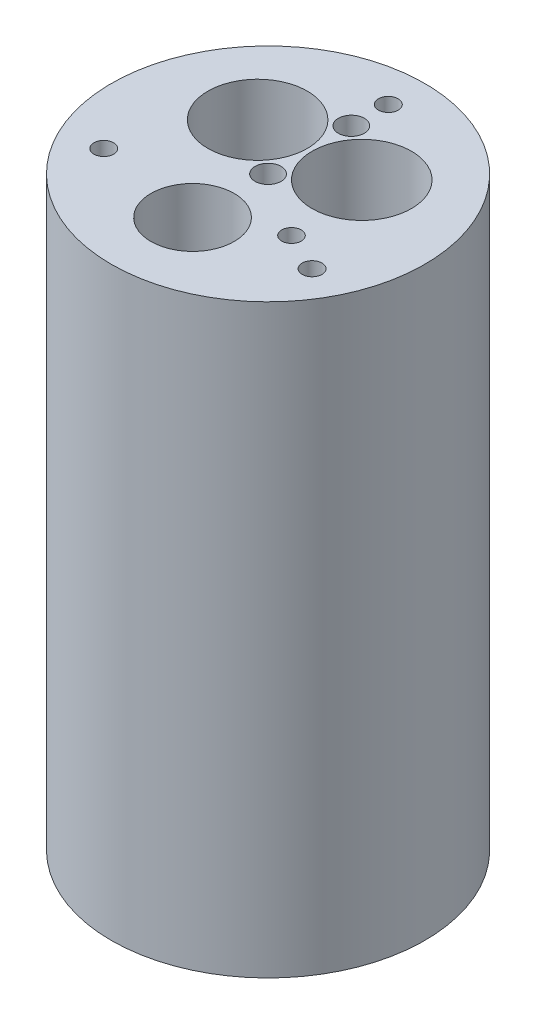
ISO-10303-21;
HEADER;
FILE_DESCRIPTION(('STEP AP214'),'2;1');
FILE_NAME('part.step','',(''),(''),'','','');
FILE_SCHEMA(('AUTOMOTIVE_DESIGN { 1 0 10303 214 1 1 1 1 }'));
ENDSEC;
DATA;
#1=APPLICATION_CONTEXT('core data for automotive mechanical design processes');
#2=APPLICATION_PROTOCOL_DEFINITION('international standard','automotive_design',2000,#1);
#3=PRODUCT_CONTEXT('',#1,'mechanical');
#4=PRODUCT('Part','Part','',(#3));
#5=PRODUCT_RELATED_PRODUCT_CATEGORY('part','',(#4));
#6=PRODUCT_DEFINITION_FORMATION('','',#4);
#7=PRODUCT_DEFINITION_CONTEXT('part definition',#1,'design');
#8=PRODUCT_DEFINITION('design','',#6,#7);
#9=PRODUCT_DEFINITION_SHAPE('','',#8);
#10=(LENGTH_UNIT() NAMED_UNIT(*) SI_UNIT(.MILLI.,.METRE.));
#11=(NAMED_UNIT(*) PLANE_ANGLE_UNIT() SI_UNIT($,.RADIAN.));
#12=(NAMED_UNIT(*) SI_UNIT($,.STERADIAN.) SOLID_ANGLE_UNIT());
#13=UNCERTAINTY_MEASURE_WITH_UNIT(LENGTH_MEASURE(1.E-05),#10,'distance_accuracy_value','');
#14=(GEOMETRIC_REPRESENTATION_CONTEXT(3) GLOBAL_UNCERTAINTY_ASSIGNED_CONTEXT((#13)) GLOBAL_UNIT_ASSIGNED_CONTEXT((#10,
#11,#12)) REPRESENTATION_CONTEXT('',''));
#15=CARTESIAN_POINT('',(0.,0.,0.));
#16=DIRECTION('',(0.,0.,1.));
#17=DIRECTION('',(1.,0.,0.));
#18=AXIS2_PLACEMENT_3D('',#15,#16,#17);
#19=CARTESIAN_POINT('',(0.,142.8496,0.));
#20=DIRECTION('',(0.,-1.,0.));
#21=DIRECTION('',(0.,0.,-1.));
#22=AXIS2_PLACEMENT_3D('',#19,#20,#21);
#23=CYLINDRICAL_SURFACE('',#22,38.227);
#24=CARTESIAN_POINT('',(0.,142.8496,0.));
#25=DIRECTION('',(0.,1.,0.));
#26=DIRECTION('',(0.,0.,1.));
#27=AXIS2_PLACEMENT_3D('',#24,#25,#26);
#28=CIRCLE('',#27,38.227);
#29=CARTESIAN_POINT('',(0.,142.8496,38.227));
#30=VERTEX_POINT('',#29);
#31=EDGE_CURVE('E10',#30,#30,#28,.T.);
#32=ORIENTED_EDGE('',*,*,#31,.F.);
#33=EDGE_LOOP('',(#32));
#34=FACE_BOUND('',#33,.T.);
#35=CARTESIAN_POINT('',(0.,0.,0.));
#36=DIRECTION('',(0.,1.,0.));
#37=DIRECTION('',(0.,0.,1.));
#38=AXIS2_PLACEMENT_3D('',#35,#36,#37);
#39=CIRCLE('',#38,38.227);
#40=CARTESIAN_POINT('',(0.,0.,38.227));
#41=VERTEX_POINT('',#40);
#42=EDGE_CURVE('E39',#41,#41,#39,.T.);
#43=ORIENTED_EDGE('',*,*,#42,.T.);
#44=EDGE_LOOP('',(#43));
#45=FACE_BOUND('',#44,.T.);
#46=ADVANCED_FACE('F36',(#34,#45),#23,.T.);
#47=CARTESIAN_POINT('',(0.,142.8496,0.));
#48=DIRECTION('',(0.,1.,0.));
#49=DIRECTION('',(0.,0.,1.));
#50=AXIS2_PLACEMENT_3D('',#47,#48,#49);
#51=PLANE('',#50);
#52=CARTESIAN_POINT('',(15.875,142.8496,10.16));
#53=DIRECTION('',(0.,1.,0.));
#54=DIRECTION('',(0.,0.,1.));
#55=AXIS2_PLACEMENT_3D('',#52,#53,#54);
#56=CIRCLE('',#55,2.38125000000001);
#57=CARTESIAN_POINT('',(15.875,142.8496,12.54125));
#58=VERTEX_POINT('',#57);
#59=EDGE_CURVE('E93',#58,#58,#56,.T.);
#60=ORIENTED_EDGE('',*,*,#59,.F.);
#61=EDGE_LOOP('',(#60));
#62=FACE_BOUND('',#61,.T.);
#63=CARTESIAN_POINT('',(0.,142.8496,18.415));
#64=DIRECTION('',(0.,1.,0.));
#65=DIRECTION('',(0.,0.,1.));
#66=AXIS2_PLACEMENT_3D('',#63,#64,#65);
#67=CIRCLE('',#66,10.16);
#68=CARTESIAN_POINT('',(0.,142.8496,28.575));
#69=VERTEX_POINT('',#68);
#70=EDGE_CURVE('E90',#69,#69,#67,.T.);
#71=ORIENTED_EDGE('',*,*,#70,.F.);
#72=EDGE_LOOP('',(#71));
#73=FACE_BOUND('',#72,.T.);
#74=CARTESIAN_POINT('',(0.,142.8496,-20.32));
#75=DIRECTION('',(0.,1.,0.));
#76=DIRECTION('',(0.,0.,1.));
#77=AXIS2_PLACEMENT_3D('',#74,#75,#76);
#78=CIRCLE('',#77,3.175);
#79=CARTESIAN_POINT('',(0.,142.8496,-17.145));
#80=VERTEX_POINT('',#79);
#81=EDGE_CURVE('E85',#80,#80,#78,.T.);
#82=ORIENTED_EDGE('',*,*,#81,.F.);
#83=EDGE_LOOP('',(#82));
#84=FACE_BOUND('',#83,.T.);
#85=CARTESIAN_POINT('',(0.,142.8496,0.));
#86=DIRECTION('',(0.,1.,0.));
#87=DIRECTION('',(0.,0.,1.));
#88=AXIS2_PLACEMENT_3D('',#85,#86,#87);
#89=CIRCLE('',#88,3.175);
#90=CARTESIAN_POINT('',(0.,142.8496,3.175));
#91=VERTEX_POINT('',#90);
#92=EDGE_CURVE('E78',#91,#91,#89,.T.);
#93=ORIENTED_EDGE('',*,*,#92,.F.);
#94=EDGE_LOOP('',(#93));
#95=FACE_BOUND('',#94,.T.);
#96=CARTESIAN_POINT('',(-12.7,142.8496,-10.16));
#97=DIRECTION('',(0.,1.,0.));
#98=DIRECTION('',(0.,0.,1.));
#99=AXIS2_PLACEMENT_3D('',#96,#97,#98);
#100=CIRCLE('',#99,12.1285);
#101=CARTESIAN_POINT('',(-12.7,142.8496,1.9685));
#102=VERTEX_POINT('',#101);
#103=EDGE_CURVE('E73',#102,#102,#100,.T.);
#104=ORIENTED_EDGE('',*,*,#103,.F.);
#105=EDGE_LOOP('',(#104));
#106=FACE_BOUND('',#105,.T.);
#107=CARTESIAN_POINT('',(12.7,142.8496,-10.16));
#108=DIRECTION('',(0.,1.,0.));
#109=DIRECTION('',(0.,0.,1.));
#110=AXIS2_PLACEMENT_3D('',#107,#108,#109);
#111=CIRCLE('',#110,12.1285);
#112=CARTESIAN_POINT('',(12.7,142.8496,1.9685));
#113=VERTEX_POINT('',#112);
#114=EDGE_CURVE('E66',#113,#113,#111,.T.);
#115=ORIENTED_EDGE('',*,*,#114,.F.);
#116=EDGE_LOOP('',(#115));
#117=FACE_BOUND('',#116,.T.);
#118=CARTESIAN_POINT('',(0.,142.8496,-29.337));
#119=DIRECTION('',(0.,1.,0.));
#120=DIRECTION('',(0.,0.,1.));
#121=AXIS2_PLACEMENT_3D('',#118,#119,#120);
#122=CIRCLE('',#121,2.413);
#123=CARTESIAN_POINT('',(0.,142.8496,-26.924));
#124=VERTEX_POINT('',#123);
#125=EDGE_CURVE('E61',#124,#124,#122,.T.);
#126=ORIENTED_EDGE('',*,*,#125,.F.);
#127=EDGE_LOOP('',(#126));
#128=FACE_BOUND('',#127,.T.);
#129=CARTESIAN_POINT('',(25.4065872708259,142.8496,14.6684999999989));
#130=DIRECTION('',(0.,1.,0.));
#131=DIRECTION('',(0.,0.,1.));
#132=AXIS2_PLACEMENT_3D('',#129,#130,#131);
#133=CIRCLE('',#132,2.4130000000016);
#134=CARTESIAN_POINT('',(25.4065872708259,142.8496,17.0815000000005));
#135=VERTEX_POINT('',#134);
#136=EDGE_CURVE('E55',#135,#135,#133,.T.);
#137=ORIENTED_EDGE('',*,*,#136,.F.);
#138=EDGE_LOOP('',(#137));
#139=FACE_BOUND('',#138,.T.);
#140=CARTESIAN_POINT('',(-25.4065872708222,142.8496,14.6685000000011));
#141=DIRECTION('',(0.,1.,0.));
#142=DIRECTION('',(0.,0.,1.));
#143=AXIS2_PLACEMENT_3D('',#140,#141,#142);
#144=CIRCLE('',#143,2.41300000000237);
#145=CARTESIAN_POINT('',(-25.4065872708222,142.8496,17.0815000000035));
#146=VERTEX_POINT('',#145);
#147=EDGE_CURVE('E48',#146,#146,#144,.T.);
#148=ORIENTED_EDGE('',*,*,#147,.F.);
#149=EDGE_LOOP('',(#148));
#150=FACE_BOUND('',#149,.T.);
#151=ORIENTED_EDGE('',*,*,#31,.T.);
#152=EDGE_LOOP('',(#151));
#153=FACE_BOUND('',#152,.T.);
#154=ADVANCED_FACE('F117',(#62,#73,#84,#95,#106,#117,#128,#139,#150,#153),#51,.T.);
#155=CARTESIAN_POINT('',(0.,0.,0.));
#156=DIRECTION('',(0.,1.,0.));
#157=DIRECTION('',(0.,0.,1.));
#158=AXIS2_PLACEMENT_3D('',#155,#156,#157);
#159=PLANE('',#158);
#160=CARTESIAN_POINT('',(15.875,0.,10.16));
#161=DIRECTION('',(0.,1.,0.));
#162=DIRECTION('',(0.,0.,1.));
#163=AXIS2_PLACEMENT_3D('',#160,#161,#162);
#164=CIRCLE('',#163,2.38125000000001);
#165=CARTESIAN_POINT('',(15.875,0.,12.54125));
#166=VERTEX_POINT('',#165);
#167=EDGE_CURVE('E98',#166,#166,#164,.T.);
#168=ORIENTED_EDGE('',*,*,#167,.T.);
#169=EDGE_LOOP('',(#168));
#170=FACE_BOUND('',#169,.T.);
#171=CARTESIAN_POINT('',(-12.7,0.,-10.16));
#172=DIRECTION('',(0.,1.,0.));
#173=DIRECTION('',(0.,0.,1.));
#174=AXIS2_PLACEMENT_3D('',#171,#172,#173);
#175=CIRCLE('',#174,12.1285);
#176=CARTESIAN_POINT('',(-12.7,0.,1.9685));
#177=VERTEX_POINT('',#176);
#178=EDGE_CURVE('E52',#177,#177,#175,.T.);
#179=ORIENTED_EDGE('',*,*,#178,.T.);
#180=EDGE_LOOP('',(#179));
#181=FACE_BOUND('',#180,.T.);
#182=CARTESIAN_POINT('',(12.7,0.,-10.16));
#183=DIRECTION('',(0.,1.,0.));
#184=DIRECTION('',(0.,0.,1.));
#185=AXIS2_PLACEMENT_3D('',#182,#183,#184);
#186=CIRCLE('',#185,12.1285);
#187=CARTESIAN_POINT('',(12.7,0.,1.9685));
#188=VERTEX_POINT('',#187);
#189=EDGE_CURVE('E69',#188,#188,#186,.T.);
#190=ORIENTED_EDGE('',*,*,#189,.T.);
#191=EDGE_LOOP('',(#190));
#192=FACE_BOUND('',#191,.T.);
#193=CARTESIAN_POINT('',(0.,0.,-29.337));
#194=DIRECTION('',(0.,1.,0.));
#195=DIRECTION('',(0.,0.,1.));
#196=AXIS2_PLACEMENT_3D('',#193,#194,#195);
#197=CIRCLE('',#196,2.413);
#198=CARTESIAN_POINT('',(0.,0.,-26.924));
#199=VERTEX_POINT('',#198);
#200=EDGE_CURVE('E46',#199,#199,#197,.T.);
#201=ORIENTED_EDGE('',*,*,#200,.T.);
#202=EDGE_LOOP('',(#201));
#203=FACE_BOUND('',#202,.T.);
#204=CARTESIAN_POINT('',(25.4065872708259,0.,14.6684999999989));
#205=DIRECTION('',(0.,1.,0.));
#206=DIRECTION('',(0.,0.,1.));
#207=AXIS2_PLACEMENT_3D('',#204,#205,#206);
#208=CIRCLE('',#207,2.4130000000016);
#209=CARTESIAN_POINT('',(25.4065872708259,0.,17.0815000000005));
#210=VERTEX_POINT('',#209);
#211=EDGE_CURVE('E58',#210,#210,#208,.T.);
#212=ORIENTED_EDGE('',*,*,#211,.T.);
#213=EDGE_LOOP('',(#212));
#214=FACE_BOUND('',#213,.T.);
#215=CARTESIAN_POINT('',(-25.4065872708222,0.,14.6685000000011));
#216=DIRECTION('',(0.,1.,0.));
#217=DIRECTION('',(0.,0.,1.));
#218=AXIS2_PLACEMENT_3D('',#215,#216,#217);
#219=CIRCLE('',#218,2.41300000000237);
#220=CARTESIAN_POINT('',(-25.4065872708222,0.,17.0815000000035));
#221=VERTEX_POINT('',#220);
#222=EDGE_CURVE('E51',#221,#221,#219,.T.);
#223=ORIENTED_EDGE('',*,*,#222,.T.);
#224=EDGE_LOOP('',(#223));
#225=FACE_BOUND('',#224,.T.);
#226=ORIENTED_EDGE('',*,*,#42,.F.);
#227=EDGE_LOOP('',(#226));
#228=FACE_BOUND('',#227,.T.);
#229=ADVANCED_FACE('F102',(#170,#181,#192,#203,#214,#225,#228),#159,.F.);
#230=CARTESIAN_POINT('',(-25.4065872708222,0.,14.6685000000011));
#231=DIRECTION('',(0.,1.,0.));
#232=DIRECTION('',(0.,0.,1.));
#233=AXIS2_PLACEMENT_3D('',#230,#231,#232);
#234=CYLINDRICAL_SURFACE('',#233,2.41300000000237);
#235=ORIENTED_EDGE('',*,*,#222,.F.);
#236=EDGE_LOOP('',(#235));
#237=FACE_BOUND('',#236,.T.);
#238=ORIENTED_EDGE('',*,*,#147,.T.);
#239=EDGE_LOOP('',(#238));
#240=FACE_BOUND('',#239,.T.);
#241=ADVANCED_FACE('F128',(#237,#240),#234,.F.);
#242=CARTESIAN_POINT('',(25.4065872708259,0.,14.6684999999989));
#243=DIRECTION('',(0.,1.,0.));
#244=DIRECTION('',(0.,0.,1.));
#245=AXIS2_PLACEMENT_3D('',#242,#243,#244);
#246=CYLINDRICAL_SURFACE('',#245,2.4130000000016);
#247=ORIENTED_EDGE('',*,*,#211,.F.);
#248=EDGE_LOOP('',(#247));
#249=FACE_BOUND('',#248,.T.);
#250=ORIENTED_EDGE('',*,*,#136,.T.);
#251=EDGE_LOOP('',(#250));
#252=FACE_BOUND('',#251,.T.);
#253=ADVANCED_FACE('F132',(#249,#252),#246,.F.);
#254=CARTESIAN_POINT('',(0.,0.,-29.337));
#255=DIRECTION('',(0.,1.,0.));
#256=DIRECTION('',(0.,0.,1.));
#257=AXIS2_PLACEMENT_3D('',#254,#255,#256);
#258=CYLINDRICAL_SURFACE('',#257,2.413);
#259=ORIENTED_EDGE('',*,*,#200,.F.);
#260=EDGE_LOOP('',(#259));
#261=FACE_BOUND('',#260,.T.);
#262=ORIENTED_EDGE('',*,*,#125,.T.);
#263=EDGE_LOOP('',(#262));
#264=FACE_BOUND('',#263,.T.);
#265=ADVANCED_FACE('F138',(#261,#264),#258,.F.);
#266=CARTESIAN_POINT('',(12.7,0.,-10.16));
#267=DIRECTION('',(0.,1.,0.));
#268=DIRECTION('',(0.,0.,1.));
#269=AXIS2_PLACEMENT_3D('',#266,#267,#268);
#270=CYLINDRICAL_SURFACE('',#269,12.1285);
#271=ORIENTED_EDGE('',*,*,#189,.F.);
#272=EDGE_LOOP('',(#271));
#273=FACE_BOUND('',#272,.T.);
#274=ORIENTED_EDGE('',*,*,#114,.T.);
#275=EDGE_LOOP('',(#274));
#276=FACE_BOUND('',#275,.T.);
#277=ADVANCED_FACE('F142',(#273,#276),#270,.F.);
#278=CARTESIAN_POINT('',(-12.7,0.,-10.16));
#279=DIRECTION('',(0.,1.,0.));
#280=DIRECTION('',(0.,0.,1.));
#281=AXIS2_PLACEMENT_3D('',#278,#279,#280);
#282=CYLINDRICAL_SURFACE('',#281,12.1285);
#283=ORIENTED_EDGE('',*,*,#178,.F.);
#284=EDGE_LOOP('',(#283));
#285=FACE_BOUND('',#284,.T.);
#286=ORIENTED_EDGE('',*,*,#103,.T.);
#287=EDGE_LOOP('',(#286));
#288=FACE_BOUND('',#287,.T.);
#289=ADVANCED_FACE('F146',(#285,#288),#282,.F.);
#290=CARTESIAN_POINT('',(0.,136.4996,0.));
#291=DIRECTION('',(0.,1.,0.));
#292=DIRECTION('',(0.,0.,1.));
#293=AXIS2_PLACEMENT_3D('',#290,#291,#292);
#294=CYLINDRICAL_SURFACE('',#293,3.175);
#295=CARTESIAN_POINT('',(0.,136.4996,0.));
#296=DIRECTION('',(0.,1.,0.));
#297=DIRECTION('',(0.,0.,1.));
#298=AXIS2_PLACEMENT_3D('',#295,#296,#297);
#299=CIRCLE('',#298,3.175);
#300=CARTESIAN_POINT('',(0.,136.4996,3.175));
#301=VERTEX_POINT('',#300);
#302=EDGE_CURVE('E81',#301,#301,#299,.T.);
#303=ORIENTED_EDGE('',*,*,#302,.F.);
#304=EDGE_LOOP('',(#303));
#305=FACE_BOUND('',#304,.T.);
#306=ORIENTED_EDGE('',*,*,#92,.T.);
#307=EDGE_LOOP('',(#306));
#308=FACE_BOUND('',#307,.T.);
#309=ADVANCED_FACE('F150',(#305,#308),#294,.F.);
#310=CARTESIAN_POINT('',(0.,136.4996,0.));
#311=DIRECTION('',(0.,1.,0.));
#312=DIRECTION('',(0.,0.,1.));
#313=AXIS2_PLACEMENT_3D('',#310,#311,#312);
#314=PLANE('',#313);
#315=ORIENTED_EDGE('',*,*,#302,.T.);
#316=EDGE_LOOP('',(#315));
#317=FACE_BOUND('',#316,.T.);
#318=ADVANCED_FACE('F154',(#317),#314,.T.);
#319=CARTESIAN_POINT('',(0.,136.4996,-20.32));
#320=DIRECTION('',(0.,1.,0.));
#321=DIRECTION('',(0.,0.,1.));
#322=AXIS2_PLACEMENT_3D('',#319,#320,#321);
#323=CYLINDRICAL_SURFACE('',#322,3.175);
#324=CARTESIAN_POINT('',(0.,136.4996,-20.32));
#325=DIRECTION('',(0.,1.,0.));
#326=DIRECTION('',(0.,0.,1.));
#327=AXIS2_PLACEMENT_3D('',#324,#325,#326);
#328=CIRCLE('',#327,3.175);
#329=CARTESIAN_POINT('',(0.,136.4996,-17.145));
#330=VERTEX_POINT('',#329);
#331=EDGE_CURVE('E70',#330,#330,#328,.T.);
#332=ORIENTED_EDGE('',*,*,#331,.F.);
#333=EDGE_LOOP('',(#332));
#334=FACE_BOUND('',#333,.T.);
#335=ORIENTED_EDGE('',*,*,#81,.T.);
#336=EDGE_LOOP('',(#335));
#337=FACE_BOUND('',#336,.T.);
#338=ADVANCED_FACE('F158',(#334,#337),#323,.F.);
#339=CARTESIAN_POINT('',(0.,136.4996,-20.32));
#340=DIRECTION('',(0.,1.,0.));
#341=DIRECTION('',(0.,0.,1.));
#342=AXIS2_PLACEMENT_3D('',#339,#340,#341);
#343=PLANE('',#342);
#344=ORIENTED_EDGE('',*,*,#331,.T.);
#345=EDGE_LOOP('',(#344));
#346=FACE_BOUND('',#345,.T.);
#347=ADVANCED_FACE('F162',(#346),#343,.T.);
#348=CARTESIAN_POINT('',(0.,125.0696,18.415));
#349=DIRECTION('',(0.,1.,0.));
#350=DIRECTION('',(0.,0.,1.));
#351=AXIS2_PLACEMENT_3D('',#348,#349,#350);
#352=CYLINDRICAL_SURFACE('',#351,10.16);
#353=CARTESIAN_POINT('',(0.,125.0696,18.415));
#354=DIRECTION('',(0.,1.,0.));
#355=DIRECTION('',(0.,0.,1.));
#356=AXIS2_PLACEMENT_3D('',#353,#354,#355);
#357=CIRCLE('',#356,10.16);
#358=CARTESIAN_POINT('',(0.,125.0696,28.575));
#359=VERTEX_POINT('',#358);
#360=EDGE_CURVE('E82',#359,#359,#357,.T.);
#361=ORIENTED_EDGE('',*,*,#360,.F.);
#362=EDGE_LOOP('',(#361));
#363=FACE_BOUND('',#362,.T.);
#364=ORIENTED_EDGE('',*,*,#70,.T.);
#365=EDGE_LOOP('',(#364));
#366=FACE_BOUND('',#365,.T.);
#367=ADVANCED_FACE('F113',(#363,#366),#352,.F.);
#368=CARTESIAN_POINT('',(0.,125.0696,18.415));
#369=DIRECTION('',(0.,1.,0.));
#370=DIRECTION('',(0.,0.,1.));
#371=AXIS2_PLACEMENT_3D('',#368,#369,#370);
#372=PLANE('',#371);
#373=ORIENTED_EDGE('',*,*,#360,.T.);
#374=EDGE_LOOP('',(#373));
#375=FACE_BOUND('',#374,.T.);
#376=ADVANCED_FACE('F107',(#375),#372,.T.);
#377=CARTESIAN_POINT('',(15.875,0.,10.16));
#378=DIRECTION('',(0.,1.,0.));
#379=DIRECTION('',(0.,0.,1.));
#380=AXIS2_PLACEMENT_3D('',#377,#378,#379);
#381=CYLINDRICAL_SURFACE('',#380,2.38125000000001);
#382=ORIENTED_EDGE('',*,*,#59,.T.);
#383=EDGE_LOOP('',(#382));
#384=FACE_BOUND('',#383,.T.);
#385=ORIENTED_EDGE('',*,*,#167,.F.);
#386=EDGE_LOOP('',(#385));
#387=FACE_BOUND('',#386,.T.);
#388=ADVANCED_FACE('F105',(#384,#387),#381,.F.);
#389=CLOSED_SHELL('',(#46,#154,#229,#241,#253,#265,#277,#289,#309,#318,#338,#347,#367,#376,#388));
#390=MANIFOLD_SOLID_BREP('B2',#389);
#391=ADVANCED_BREP_SHAPE_REPRESENTATION('',(#18,#390),#14);
#392=SHAPE_DEFINITION_REPRESENTATION(#9,#391);
ENDSEC;
END-ISO-10303-21;
